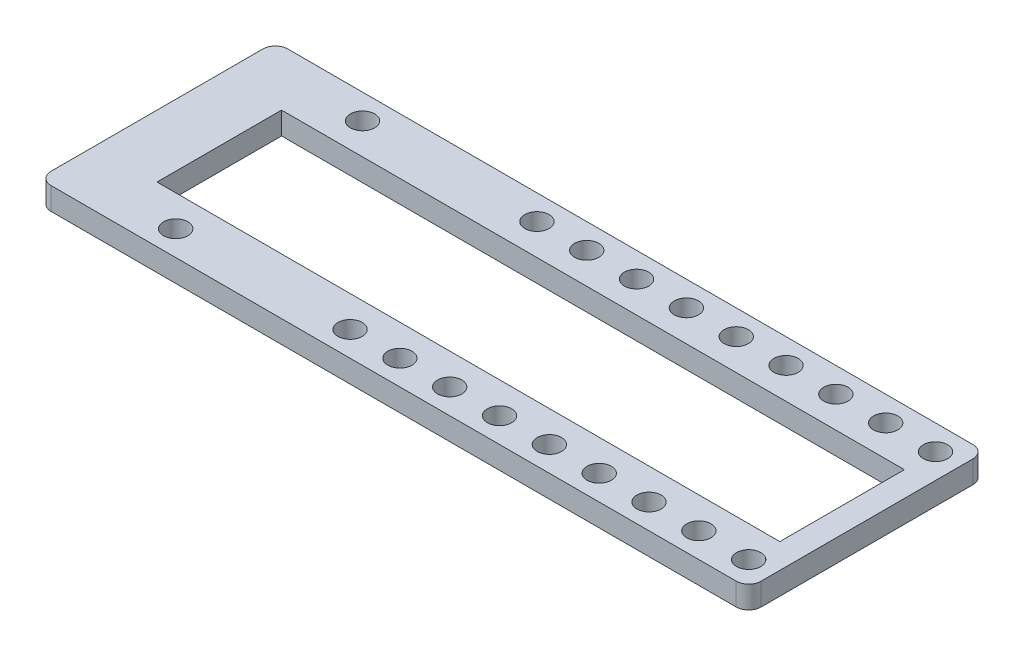
ISO-10303-21;
HEADER;
FILE_DESCRIPTION(('STEP AP214'),'2;1');
FILE_NAME('part.step','',(''),(''),'','','');
FILE_SCHEMA(('AUTOMOTIVE_DESIGN { 1 0 10303 214 1 1 1 1 }'));
ENDSEC;
DATA;
#1=APPLICATION_CONTEXT('core data for automotive mechanical design processes');
#2=APPLICATION_PROTOCOL_DEFINITION('international standard','automotive_design',2000,#1);
#3=PRODUCT_CONTEXT('',#1,'mechanical');
#4=PRODUCT('Part','Part','',(#3));
#5=PRODUCT_RELATED_PRODUCT_CATEGORY('part','',(#4));
#6=PRODUCT_DEFINITION_FORMATION('','',#4);
#7=PRODUCT_DEFINITION_CONTEXT('part definition',#1,'design');
#8=PRODUCT_DEFINITION('design','',#6,#7);
#9=PRODUCT_DEFINITION_SHAPE('','',#8);
#10=(LENGTH_UNIT() NAMED_UNIT(*) SI_UNIT(.MILLI.,.METRE.));
#11=(NAMED_UNIT(*) PLANE_ANGLE_UNIT() SI_UNIT($,.RADIAN.));
#12=(NAMED_UNIT(*) SI_UNIT($,.STERADIAN.) SOLID_ANGLE_UNIT());
#13=UNCERTAINTY_MEASURE_WITH_UNIT(LENGTH_MEASURE(1.E-05),#10,'distance_accuracy_value','');
#14=(GEOMETRIC_REPRESENTATION_CONTEXT(3) GLOBAL_UNCERTAINTY_ASSIGNED_CONTEXT((#13)) GLOBAL_UNIT_ASSIGNED_CONTEXT((#10,
#11,#12)) REPRESENTATION_CONTEXT('',''));
#15=CARTESIAN_POINT('',(0.,0.,0.));
#16=DIRECTION('',(0.,0.,1.));
#17=DIRECTION('',(1.,0.,0.));
#18=AXIS2_PLACEMENT_3D('',#15,#16,#17);
#19=CARTESIAN_POINT('',(112.,3.6,36.));
#20=DIRECTION('',(0.,-1.,0.));
#21=DIRECTION('',(0.,0.,-1.));
#22=AXIS2_PLACEMENT_3D('',#19,#20,#21);
#23=CYLINDRICAL_SURFACE('',#22,2.00000000000001);
#24=CARTESIAN_POINT('',(112.,0.,36.));
#25=DIRECTION('',(0.,1.,0.));
#26=DIRECTION('',(0.,0.,1.));
#27=AXIS2_PLACEMENT_3D('',#24,#25,#26);
#28=CIRCLE('',#27,2.00000000000001);
#29=CARTESIAN_POINT('',(112.,0.,38.));
#30=VERTEX_POINT('',#29);
#31=CARTESIAN_POINT('',(114.,0.,36.));
#32=VERTEX_POINT('',#31);
#33=EDGE_CURVE('E275',#30,#32,#28,.T.);
#34=ORIENTED_EDGE('',*,*,#33,.T.);
#35=DIRECTION('',(0.,-1.,0.));
#36=VECTOR('',#35,1.);
#37=CARTESIAN_POINT('',(114.,3.6,36.));
#38=LINE('',#37,#36);
#39=CARTESIAN_POINT('',(114.,3.6,36.));
#40=VERTEX_POINT('',#39);
#41=EDGE_CURVE('E11',#40,#32,#38,.T.);
#42=ORIENTED_EDGE('',*,*,#41,.F.);
#43=CARTESIAN_POINT('',(112.,3.6,36.));
#44=DIRECTION('',(0.,1.,0.));
#45=DIRECTION('',(0.,0.,1.));
#46=AXIS2_PLACEMENT_3D('',#43,#44,#45);
#47=CIRCLE('',#46,2.00000000000001);
#48=CARTESIAN_POINT('',(112.,3.6,38.));
#49=VERTEX_POINT('',#48);
#50=EDGE_CURVE('E278',#49,#40,#47,.T.);
#51=ORIENTED_EDGE('',*,*,#50,.F.);
#52=DIRECTION('',(0.,-1.,0.));
#53=VECTOR('',#52,1.);
#54=CARTESIAN_POINT('',(112.,3.6,38.));
#55=LINE('',#54,#53);
#56=EDGE_CURVE('E296',#49,#30,#55,.T.);
#57=ORIENTED_EDGE('',*,*,#56,.T.);
#58=EDGE_LOOP('',(#34,#42,#51,#57));
#59=FACE_BOUND('',#58,.T.);
#60=ADVANCED_FACE('F35',(#59),#23,.T.);
#61=CARTESIAN_POINT('',(114.,3.6,2.));
#62=DIRECTION('',(-1.,0.,0.));
#63=DIRECTION('',(0.,0.,1.));
#64=AXIS2_PLACEMENT_3D('',#61,#62,#63);
#65=PLANE('',#64);
#66=DIRECTION('',(0.,0.,-1.));
#67=VECTOR('',#66,1.);
#68=CARTESIAN_POINT('',(114.,0.,2.));
#69=LINE('',#68,#67);
#70=CARTESIAN_POINT('',(114.,0.,2.));
#71=VERTEX_POINT('',#70);
#72=EDGE_CURVE('E299',#32,#71,#69,.T.);
#73=ORIENTED_EDGE('',*,*,#72,.T.);
#74=DIRECTION('',(0.,-1.,0.));
#75=VECTOR('',#74,1.);
#76=CARTESIAN_POINT('',(114.,3.6,2.));
#77=LINE('',#76,#75);
#78=CARTESIAN_POINT('',(114.,3.6,2.));
#79=VERTEX_POINT('',#78);
#80=EDGE_CURVE('E42',#79,#71,#77,.T.);
#81=ORIENTED_EDGE('',*,*,#80,.F.);
#82=DIRECTION('',(0.,0.,-1.));
#83=VECTOR('',#82,1.);
#84=CARTESIAN_POINT('',(114.,3.6,2.));
#85=LINE('',#84,#83);
#86=EDGE_CURVE('E281',#40,#79,#85,.T.);
#87=ORIENTED_EDGE('',*,*,#86,.F.);
#88=ORIENTED_EDGE('',*,*,#41,.T.);
#89=EDGE_LOOP('',(#73,#81,#87,#88));
#90=FACE_BOUND('',#89,.T.);
#91=ADVANCED_FACE('F355',(#90),#65,.F.);
#92=CARTESIAN_POINT('',(112.,3.6,2.));
#93=DIRECTION('',(0.,-1.,0.));
#94=DIRECTION('',(0.,0.,-1.));
#95=AXIS2_PLACEMENT_3D('',#92,#93,#94);
#96=CYLINDRICAL_SURFACE('',#95,2.);
#97=CARTESIAN_POINT('',(112.,0.,2.));
#98=DIRECTION('',(0.,1.,0.));
#99=DIRECTION('',(0.,0.,-1.));
#100=AXIS2_PLACEMENT_3D('',#97,#98,#99);
#101=CIRCLE('',#100,2.);
#102=CARTESIAN_POINT('',(112.,0.,0.));
#103=VERTEX_POINT('',#102);
#104=EDGE_CURVE('E301',#71,#103,#101,.T.);
#105=ORIENTED_EDGE('',*,*,#104,.T.);
#106=DIRECTION('',(0.,-1.,0.));
#107=VECTOR('',#106,1.);
#108=CARTESIAN_POINT('',(112.,3.6,0.));
#109=LINE('',#108,#107);
#110=CARTESIAN_POINT('',(112.,3.6,0.));
#111=VERTEX_POINT('',#110);
#112=EDGE_CURVE('E326',#111,#103,#109,.T.);
#113=ORIENTED_EDGE('',*,*,#112,.F.);
#114=CARTESIAN_POINT('',(112.,3.6,2.));
#115=DIRECTION('',(0.,1.,0.));
#116=DIRECTION('',(0.,0.,-1.));
#117=AXIS2_PLACEMENT_3D('',#114,#115,#116);
#118=CIRCLE('',#117,2.);
#119=EDGE_CURVE('E284',#79,#111,#118,.T.);
#120=ORIENTED_EDGE('',*,*,#119,.F.);
#121=ORIENTED_EDGE('',*,*,#80,.T.);
#122=EDGE_LOOP('',(#105,#113,#120,#121));
#123=FACE_BOUND('',#122,.T.);
#124=ADVANCED_FACE('F333',(#123),#96,.T.);
#125=CARTESIAN_POINT('',(2.00000000000001,3.6,0.));
#126=DIRECTION('',(0.,0.,1.));
#127=DIRECTION('',(1.,0.,0.));
#128=AXIS2_PLACEMENT_3D('',#125,#126,#127);
#129=PLANE('',#128);
#130=DIRECTION('',(-1.,0.,0.));
#131=VECTOR('',#130,1.);
#132=CARTESIAN_POINT('',(2.00000000000001,0.,0.));
#133=LINE('',#132,#131);
#134=CARTESIAN_POINT('',(2.00000000000001,0.,0.));
#135=VERTEX_POINT('',#134);
#136=EDGE_CURVE('E303',#103,#135,#133,.T.);
#137=ORIENTED_EDGE('',*,*,#136,.T.);
#138=DIRECTION('',(0.,-1.,0.));
#139=VECTOR('',#138,1.);
#140=CARTESIAN_POINT('',(2.00000000000001,3.6,0.));
#141=LINE('',#140,#139);
#142=CARTESIAN_POINT('',(2.00000000000001,3.6,0.));
#143=VERTEX_POINT('',#142);
#144=EDGE_CURVE('E323',#143,#135,#141,.T.);
#145=ORIENTED_EDGE('',*,*,#144,.F.);
#146=DIRECTION('',(-1.,0.,0.));
#147=VECTOR('',#146,1.);
#148=CARTESIAN_POINT('',(2.00000000000001,3.6,0.));
#149=LINE('',#148,#147);
#150=EDGE_CURVE('E286',#111,#143,#149,.T.);
#151=ORIENTED_EDGE('',*,*,#150,.F.);
#152=ORIENTED_EDGE('',*,*,#112,.T.);
#153=EDGE_LOOP('',(#137,#145,#151,#152));
#154=FACE_BOUND('',#153,.T.);
#155=ADVANCED_FACE('F343',(#154),#129,.F.);
#156=CARTESIAN_POINT('',(2.,3.6,2.));
#157=DIRECTION('',(0.,-1.,0.));
#158=DIRECTION('',(0.,0.,-1.));
#159=AXIS2_PLACEMENT_3D('',#156,#157,#158);
#160=CYLINDRICAL_SURFACE('',#159,2.);
#161=CARTESIAN_POINT('',(2.,0.,2.));
#162=DIRECTION('',(0.,1.,0.));
#163=DIRECTION('',(0.,0.,1.));
#164=AXIS2_PLACEMENT_3D('',#161,#162,#163);
#165=CIRCLE('',#164,2.);
#166=CARTESIAN_POINT('',(0.,0.,2.00000000000001));
#167=VERTEX_POINT('',#166);
#168=EDGE_CURVE('E305',#135,#167,#165,.T.);
#169=ORIENTED_EDGE('',*,*,#168,.T.);
#170=DIRECTION('',(0.,-1.,0.));
#171=VECTOR('',#170,1.);
#172=CARTESIAN_POINT('',(0.,3.6,2.00000000000001));
#173=LINE('',#172,#171);
#174=CARTESIAN_POINT('',(0.,3.6,2.00000000000001));
#175=VERTEX_POINT('',#174);
#176=EDGE_CURVE('E320',#175,#167,#173,.T.);
#177=ORIENTED_EDGE('',*,*,#176,.F.);
#178=CARTESIAN_POINT('',(2.,3.6,2.));
#179=DIRECTION('',(0.,1.,0.));
#180=DIRECTION('',(0.,0.,1.));
#181=AXIS2_PLACEMENT_3D('',#178,#179,#180);
#182=CIRCLE('',#181,2.);
#183=EDGE_CURVE('E288',#143,#175,#182,.T.);
#184=ORIENTED_EDGE('',*,*,#183,.F.);
#185=ORIENTED_EDGE('',*,*,#144,.T.);
#186=EDGE_LOOP('',(#169,#177,#184,#185));
#187=FACE_BOUND('',#186,.T.);
#188=ADVANCED_FACE('F347',(#187),#160,.T.);
#189=CARTESIAN_POINT('',(0.,3.6,2.00000000000001));
#190=DIRECTION('',(1.,0.,0.));
#191=DIRECTION('',(0.,0.,-1.));
#192=AXIS2_PLACEMENT_3D('',#189,#190,#191);
#193=PLANE('',#192);
#194=DIRECTION('',(0.,0.,1.));
#195=VECTOR('',#194,1.);
#196=CARTESIAN_POINT('',(0.,0.,2.00000000000001));
#197=LINE('',#196,#195);
#198=CARTESIAN_POINT('',(0.,0.,36.));
#199=VERTEX_POINT('',#198);
#200=EDGE_CURVE('E307',#167,#199,#197,.T.);
#201=ORIENTED_EDGE('',*,*,#200,.T.);
#202=DIRECTION('',(0.,-1.,0.));
#203=VECTOR('',#202,1.);
#204=CARTESIAN_POINT('',(0.,3.6,36.));
#205=LINE('',#204,#203);
#206=CARTESIAN_POINT('',(0.,3.6,36.));
#207=VERTEX_POINT('',#206);
#208=EDGE_CURVE('E317',#207,#199,#205,.T.);
#209=ORIENTED_EDGE('',*,*,#208,.F.);
#210=DIRECTION('',(0.,0.,1.));
#211=VECTOR('',#210,1.);
#212=CARTESIAN_POINT('',(0.,3.6,2.00000000000001));
#213=LINE('',#212,#211);
#214=EDGE_CURVE('E290',#175,#207,#213,.T.);
#215=ORIENTED_EDGE('',*,*,#214,.F.);
#216=ORIENTED_EDGE('',*,*,#176,.T.);
#217=EDGE_LOOP('',(#201,#209,#215,#216));
#218=FACE_BOUND('',#217,.T.);
#219=ADVANCED_FACE('F368',(#218),#193,.F.);
#220=CARTESIAN_POINT('',(2.,3.6,36.));
#221=DIRECTION('',(0.,-1.,0.));
#222=DIRECTION('',(0.,0.,-1.));
#223=AXIS2_PLACEMENT_3D('',#220,#221,#222);
#224=CYLINDRICAL_SURFACE('',#223,2.);
#225=CARTESIAN_POINT('',(2.,0.,36.));
#226=DIRECTION('',(0.,1.,0.));
#227=DIRECTION('',(0.,0.,1.));
#228=AXIS2_PLACEMENT_3D('',#225,#226,#227);
#229=CIRCLE('',#228,2.);
#230=CARTESIAN_POINT('',(2.,0.,38.));
#231=VERTEX_POINT('',#230);
#232=EDGE_CURVE('E309',#199,#231,#229,.T.);
#233=ORIENTED_EDGE('',*,*,#232,.T.);
#234=DIRECTION('',(0.,-1.,0.));
#235=VECTOR('',#234,1.);
#236=CARTESIAN_POINT('',(2.,3.6,38.));
#237=LINE('',#236,#235);
#238=CARTESIAN_POINT('',(2.,3.6,38.));
#239=VERTEX_POINT('',#238);
#240=EDGE_CURVE('E314',#239,#231,#237,.T.);
#241=ORIENTED_EDGE('',*,*,#240,.F.);
#242=CARTESIAN_POINT('',(2.,3.6,36.));
#243=DIRECTION('',(0.,1.,0.));
#244=DIRECTION('',(0.,0.,1.));
#245=AXIS2_PLACEMENT_3D('',#242,#243,#244);
#246=CIRCLE('',#245,2.);
#247=EDGE_CURVE('E292',#207,#239,#246,.T.);
#248=ORIENTED_EDGE('',*,*,#247,.F.);
#249=ORIENTED_EDGE('',*,*,#208,.T.);
#250=EDGE_LOOP('',(#233,#241,#248,#249));
#251=FACE_BOUND('',#250,.T.);
#252=ADVANCED_FACE('F366',(#251),#224,.T.);
#253=CARTESIAN_POINT('',(2.,3.6,38.));
#254=DIRECTION('',(0.,0.,-1.));
#255=DIRECTION('',(-1.,0.,0.));
#256=AXIS2_PLACEMENT_3D('',#253,#254,#255);
#257=PLANE('',#256);
#258=DIRECTION('',(1.,0.,0.));
#259=VECTOR('',#258,1.);
#260=CARTESIAN_POINT('',(2.,0.,38.));
#261=LINE('',#260,#259);
#262=EDGE_CURVE('E282',#231,#30,#261,.T.);
#263=ORIENTED_EDGE('',*,*,#262,.T.);
#264=ORIENTED_EDGE('',*,*,#56,.F.);
#265=DIRECTION('',(1.,0.,0.));
#266=VECTOR('',#265,1.);
#267=CARTESIAN_POINT('',(2.,3.6,38.));
#268=LINE('',#267,#266);
#269=EDGE_CURVE('E294',#239,#49,#268,.T.);
#270=ORIENTED_EDGE('',*,*,#269,.F.);
#271=ORIENTED_EDGE('',*,*,#240,.T.);
#272=EDGE_LOOP('',(#263,#264,#270,#271));
#273=FACE_BOUND('',#272,.T.);
#274=ADVANCED_FACE('F361',(#273),#257,.F.);
#275=CARTESIAN_POINT('',(112.,3.6,36.));
#276=DIRECTION('',(0.,1.,0.));
#277=DIRECTION('',(0.,0.,1.));
#278=AXIS2_PLACEMENT_3D('',#275,#276,#277);
#279=PLANE('',#278);
#280=CARTESIAN_POINT('',(18.,3.6,34.));
#281=DIRECTION('',(0.,1.,0.));
#282=DIRECTION('',(0.,0.,1.));
#283=AXIS2_PLACEMENT_3D('',#280,#281,#282);
#284=CIRCLE('',#283,1.95);
#285=CARTESIAN_POINT('',(18.,3.6,35.95));
#286=VERTEX_POINT('',#285);
#287=EDGE_CURVE('E179',#286,#286,#284,.T.);
#288=ORIENTED_EDGE('',*,*,#287,.F.);
#289=EDGE_LOOP('',(#288));
#290=FACE_BOUND('',#289,.T.);
#291=CARTESIAN_POINT('',(102.,3.6,34.));
#292=DIRECTION('',(0.,1.,0.));
#293=DIRECTION('',(0.,0.,1.));
#294=AXIS2_PLACEMENT_3D('',#291,#292,#293);
#295=CIRCLE('',#294,1.95);
#296=CARTESIAN_POINT('',(102.,3.6,35.95));
#297=VERTEX_POINT('',#296);
#298=EDGE_CURVE('E204',#297,#297,#295,.T.);
#299=ORIENTED_EDGE('',*,*,#298,.F.);
#300=EDGE_LOOP('',(#299));
#301=FACE_BOUND('',#300,.T.);
#302=CARTESIAN_POINT('',(110.,3.6,34.));
#303=DIRECTION('',(0.,1.,0.));
#304=DIRECTION('',(0.,0.,1.));
#305=AXIS2_PLACEMENT_3D('',#302,#303,#304);
#306=CIRCLE('',#305,1.95);
#307=CARTESIAN_POINT('',(110.,3.6,35.95));
#308=VERTEX_POINT('',#307);
#309=EDGE_CURVE('E203',#308,#308,#306,.T.);
#310=ORIENTED_EDGE('',*,*,#309,.F.);
#311=EDGE_LOOP('',(#310));
#312=FACE_BOUND('',#311,.T.);
#313=CARTESIAN_POINT('',(94.,3.6,4.));
#314=DIRECTION('',(0.,1.,0.));
#315=DIRECTION('',(0.,0.,1.));
#316=AXIS2_PLACEMENT_3D('',#313,#314,#315);
#317=CIRCLE('',#316,1.95);
#318=CARTESIAN_POINT('',(94.,3.6,5.95));
#319=VERTEX_POINT('',#318);
#320=EDGE_CURVE('E216',#319,#319,#317,.T.);
#321=ORIENTED_EDGE('',*,*,#320,.F.);
#322=EDGE_LOOP('',(#321));
#323=FACE_BOUND('',#322,.T.);
#324=CARTESIAN_POINT('',(46.,3.6,34.));
#325=DIRECTION('',(0.,1.,0.));
#326=DIRECTION('',(0.,0.,1.));
#327=AXIS2_PLACEMENT_3D('',#324,#325,#326);
#328=CIRCLE('',#327,1.95);
#329=CARTESIAN_POINT('',(46.,3.6,35.95));
#330=VERTEX_POINT('',#329);
#331=EDGE_CURVE('E180',#330,#330,#328,.T.);
#332=ORIENTED_EDGE('',*,*,#331,.F.);
#333=EDGE_LOOP('',(#332));
#334=FACE_BOUND('',#333,.T.);
#335=CARTESIAN_POINT('',(54.,3.6,34.));
#336=DIRECTION('',(0.,1.,0.));
#337=DIRECTION('',(0.,0.,1.));
#338=AXIS2_PLACEMENT_3D('',#335,#336,#337);
#339=CIRCLE('',#338,1.95);
#340=CARTESIAN_POINT('',(54.,3.6,35.95));
#341=VERTEX_POINT('',#340);
#342=EDGE_CURVE('E186',#341,#341,#339,.T.);
#343=ORIENTED_EDGE('',*,*,#342,.F.);
#344=EDGE_LOOP('',(#343));
#345=FACE_BOUND('',#344,.T.);
#346=CARTESIAN_POINT('',(62.,3.6,34.));
#347=DIRECTION('',(0.,1.,0.));
#348=DIRECTION('',(0.,0.,1.));
#349=AXIS2_PLACEMENT_3D('',#346,#347,#348);
#350=CIRCLE('',#349,1.95000000000001);
#351=CARTESIAN_POINT('',(62.,3.6,35.95));
#352=VERTEX_POINT('',#351);
#353=EDGE_CURVE('E192',#352,#352,#350,.T.);
#354=ORIENTED_EDGE('',*,*,#353,.F.);
#355=EDGE_LOOP('',(#354));
#356=FACE_BOUND('',#355,.T.);
#357=CARTESIAN_POINT('',(70.,3.6,34.));
#358=DIRECTION('',(0.,1.,0.));
#359=DIRECTION('',(0.,0.,1.));
#360=AXIS2_PLACEMENT_3D('',#357,#358,#359);
#361=CIRCLE('',#360,1.95);
#362=CARTESIAN_POINT('',(70.,3.6,35.95));
#363=VERTEX_POINT('',#362);
#364=EDGE_CURVE('E165',#363,#363,#361,.T.);
#365=ORIENTED_EDGE('',*,*,#364,.F.);
#366=EDGE_LOOP('',(#365));
#367=FACE_BOUND('',#366,.T.);
#368=CARTESIAN_POINT('',(54.,3.6,4.00000000000001));
#369=DIRECTION('',(0.,1.,0.));
#370=DIRECTION('',(0.,0.,1.));
#371=AXIS2_PLACEMENT_3D('',#368,#369,#370);
#372=CIRCLE('',#371,1.95);
#373=CARTESIAN_POINT('',(54.,3.6,5.95));
#374=VERTEX_POINT('',#373);
#375=EDGE_CURVE('E227',#374,#374,#372,.T.);
#376=ORIENTED_EDGE('',*,*,#375,.F.);
#377=EDGE_LOOP('',(#376));
#378=FACE_BOUND('',#377,.T.);
#379=CARTESIAN_POINT('',(46.,3.6,4.00000000000001));
#380=DIRECTION('',(0.,1.,0.));
#381=DIRECTION('',(0.,0.,1.));
#382=AXIS2_PLACEMENT_3D('',#379,#380,#381);
#383=CIRCLE('',#382,1.95);
#384=CARTESIAN_POINT('',(46.,3.6,5.95));
#385=VERTEX_POINT('',#384);
#386=EDGE_CURVE('E252',#385,#385,#383,.T.);
#387=ORIENTED_EDGE('',*,*,#386,.F.);
#388=EDGE_LOOP('',(#387));
#389=FACE_BOUND('',#388,.T.);
#390=CARTESIAN_POINT('',(18.,3.6,4.00000000000001));
#391=DIRECTION('',(0.,1.,0.));
#392=DIRECTION('',(0.,0.,1.));
#393=AXIS2_PLACEMENT_3D('',#390,#391,#392);
#394=CIRCLE('',#393,1.95);
#395=CARTESIAN_POINT('',(18.,3.6,5.95000000000001));
#396=VERTEX_POINT('',#395);
#397=EDGE_CURVE('E251',#396,#396,#394,.T.);
#398=ORIENTED_EDGE('',*,*,#397,.F.);
#399=EDGE_LOOP('',(#398));
#400=FACE_BOUND('',#399,.T.);
#401=CARTESIAN_POINT('',(102.,3.6,4.));
#402=DIRECTION('',(0.,1.,0.));
#403=DIRECTION('',(0.,0.,1.));
#404=AXIS2_PLACEMENT_3D('',#401,#402,#403);
#405=CIRCLE('',#404,1.95);
#406=CARTESIAN_POINT('',(102.,3.6,5.95));
#407=VERTEX_POINT('',#406);
#408=EDGE_CURVE('E264',#407,#407,#405,.T.);
#409=ORIENTED_EDGE('',*,*,#408,.F.);
#410=EDGE_LOOP('',(#409));
#411=FACE_BOUND('',#410,.T.);
#412=CARTESIAN_POINT('',(62.,3.6,4.));
#413=DIRECTION('',(0.,1.,0.));
#414=DIRECTION('',(0.,0.,1.));
#415=AXIS2_PLACEMENT_3D('',#412,#413,#414);
#416=CIRCLE('',#415,1.95000000000001);
#417=CARTESIAN_POINT('',(62.,3.6,5.95000000000001));
#418=VERTEX_POINT('',#417);
#419=EDGE_CURVE('E228',#418,#418,#416,.T.);
#420=ORIENTED_EDGE('',*,*,#419,.F.);
#421=EDGE_LOOP('',(#420));
#422=FACE_BOUND('',#421,.T.);
#423=CARTESIAN_POINT('',(70.,3.6,4.));
#424=DIRECTION('',(0.,1.,0.));
#425=DIRECTION('',(0.,0.,1.));
#426=AXIS2_PLACEMENT_3D('',#423,#424,#425);
#427=CIRCLE('',#426,1.95);
#428=CARTESIAN_POINT('',(70.,3.6,5.95));
#429=VERTEX_POINT('',#428);
#430=EDGE_CURVE('E234',#429,#429,#427,.T.);
#431=ORIENTED_EDGE('',*,*,#430,.F.);
#432=EDGE_LOOP('',(#431));
#433=FACE_BOUND('',#432,.T.);
#434=CARTESIAN_POINT('',(78.,3.6,4.));
#435=DIRECTION('',(0.,1.,0.));
#436=DIRECTION('',(0.,0.,1.));
#437=AXIS2_PLACEMENT_3D('',#434,#435,#436);
#438=CIRCLE('',#437,1.95);
#439=CARTESIAN_POINT('',(78.,3.6,5.95));
#440=VERTEX_POINT('',#439);
#441=EDGE_CURVE('E240',#440,#440,#438,.T.);
#442=ORIENTED_EDGE('',*,*,#441,.F.);
#443=EDGE_LOOP('',(#442));
#444=FACE_BOUND('',#443,.T.);
#445=CARTESIAN_POINT('',(86.,3.6,4.));
#446=DIRECTION('',(0.,1.,0.));
#447=DIRECTION('',(0.,0.,1.));
#448=AXIS2_PLACEMENT_3D('',#445,#446,#447);
#449=CIRCLE('',#448,1.95);
#450=CARTESIAN_POINT('',(86.,3.6,5.95));
#451=VERTEX_POINT('',#450);
#452=EDGE_CURVE('E215',#451,#451,#449,.T.);
#453=ORIENTED_EDGE('',*,*,#452,.F.);
#454=EDGE_LOOP('',(#453));
#455=FACE_BOUND('',#454,.T.);
#456=DIRECTION('',(0.,0.,1.));
#457=VECTOR('',#456,1.);
#458=CARTESIAN_POINT('',(10.,3.6,9.));
#459=LINE('',#458,#457);
#460=CARTESIAN_POINT('',(10.,3.6,9.));
#461=VERTEX_POINT('',#460);
#462=CARTESIAN_POINT('',(10.,3.6,29.));
#463=VERTEX_POINT('',#462);
#464=EDGE_CURVE('E49',#461,#463,#459,.T.);
#465=ORIENTED_EDGE('',*,*,#464,.F.);
#466=DIRECTION('',(-1.,0.,0.));
#467=VECTOR('',#466,1.);
#468=CARTESIAN_POINT('',(10.,3.6,9.));
#469=LINE('',#468,#467);
#470=CARTESIAN_POINT('',(110.,3.6,9.));
#471=VERTEX_POINT('',#470);
#472=EDGE_CURVE('E141',#471,#461,#469,.T.);
#473=ORIENTED_EDGE('',*,*,#472,.F.);
#474=DIRECTION('',(0.,0.,-1.));
#475=VECTOR('',#474,1.);
#476=CARTESIAN_POINT('',(110.,3.6,9.));
#477=LINE('',#476,#475);
#478=CARTESIAN_POINT('',(110.,3.6,29.));
#479=VERTEX_POINT('',#478);
#480=EDGE_CURVE('E144',#479,#471,#477,.T.);
#481=ORIENTED_EDGE('',*,*,#480,.F.);
#482=DIRECTION('',(1.,0.,0.));
#483=VECTOR('',#482,1.);
#484=CARTESIAN_POINT('',(10.,3.6,29.));
#485=LINE('',#484,#483);
#486=EDGE_CURVE('E153',#463,#479,#485,.T.);
#487=ORIENTED_EDGE('',*,*,#486,.F.);
#488=EDGE_LOOP('',(#465,#473,#481,#487));
#489=FACE_BOUND('',#488,.T.);
#490=CARTESIAN_POINT('',(94.,3.6,34.));
#491=DIRECTION('',(0.,1.,0.));
#492=DIRECTION('',(0.,0.,1.));
#493=AXIS2_PLACEMENT_3D('',#490,#491,#492);
#494=CIRCLE('',#493,1.95);
#495=CARTESIAN_POINT('',(94.,3.6,35.95));
#496=VERTEX_POINT('',#495);
#497=EDGE_CURVE('E147',#496,#496,#494,.T.);
#498=ORIENTED_EDGE('',*,*,#497,.F.);
#499=EDGE_LOOP('',(#498));
#500=FACE_BOUND('',#499,.T.);
#501=CARTESIAN_POINT('',(86.,3.6,34.));
#502=DIRECTION('',(0.,1.,0.));
#503=DIRECTION('',(0.,0.,1.));
#504=AXIS2_PLACEMENT_3D('',#501,#502,#503);
#505=CIRCLE('',#504,1.95);
#506=CARTESIAN_POINT('',(86.,3.6,35.95));
#507=VERTEX_POINT('',#506);
#508=EDGE_CURVE('E172',#507,#507,#505,.T.);
#509=ORIENTED_EDGE('',*,*,#508,.F.);
#510=EDGE_LOOP('',(#509));
#511=FACE_BOUND('',#510,.T.);
#512=CARTESIAN_POINT('',(78.,3.6,34.));
#513=DIRECTION('',(0.,1.,0.));
#514=DIRECTION('',(0.,0.,1.));
#515=AXIS2_PLACEMENT_3D('',#512,#513,#514);
#516=CIRCLE('',#515,1.95);
#517=CARTESIAN_POINT('',(78.,3.6,35.95));
#518=VERTEX_POINT('',#517);
#519=EDGE_CURVE('E166',#518,#518,#516,.T.);
#520=ORIENTED_EDGE('',*,*,#519,.F.);
#521=EDGE_LOOP('',(#520));
#522=FACE_BOUND('',#521,.T.);
#523=CARTESIAN_POINT('',(110.,3.6,4.));
#524=DIRECTION('',(0.,1.,0.));
#525=DIRECTION('',(0.,0.,1.));
#526=AXIS2_PLACEMENT_3D('',#523,#524,#525);
#527=CIRCLE('',#526,1.95);
#528=CARTESIAN_POINT('',(110.,3.6,5.94999999999999));
#529=VERTEX_POINT('',#528);
#530=EDGE_CURVE('E263',#529,#529,#527,.T.);
#531=ORIENTED_EDGE('',*,*,#530,.F.);
#532=EDGE_LOOP('',(#531));
#533=FACE_BOUND('',#532,.T.);
#534=ORIENTED_EDGE('',*,*,#50,.T.);
#535=ORIENTED_EDGE('',*,*,#86,.T.);
#536=ORIENTED_EDGE('',*,*,#119,.T.);
#537=ORIENTED_EDGE('',*,*,#150,.T.);
#538=ORIENTED_EDGE('',*,*,#183,.T.);
#539=ORIENTED_EDGE('',*,*,#214,.T.);
#540=ORIENTED_EDGE('',*,*,#247,.T.);
#541=ORIENTED_EDGE('',*,*,#269,.T.);
#542=EDGE_LOOP('',(#534,#535,#536,#537,#538,#539,#540,#541));
#543=FACE_BOUND('',#542,.T.);
#544=ADVANCED_FACE('F351',(#290,#301,#312,#323,#334,#345,#356,#367,#378,#389,#400,#411,#422,
#433,#444,#455,#489,#500,#511,#522,#533,#543),#279,.T.);
#545=CARTESIAN_POINT('',(112.,0.,36.));
#546=DIRECTION('',(0.,1.,0.));
#547=DIRECTION('',(0.,0.,1.));
#548=AXIS2_PLACEMENT_3D('',#545,#546,#547);
#549=PLANE('',#548);
#550=CARTESIAN_POINT('',(18.,0.,34.));
#551=DIRECTION('',(0.,1.,0.));
#552=DIRECTION('',(0.,0.,1.));
#553=AXIS2_PLACEMENT_3D('',#550,#551,#552);
#554=CIRCLE('',#553,1.95);
#555=CARTESIAN_POINT('',(18.,0.,35.95));
#556=VERTEX_POINT('',#555);
#557=EDGE_CURVE('E207',#556,#556,#554,.T.);
#558=ORIENTED_EDGE('',*,*,#557,.T.);
#559=EDGE_LOOP('',(#558));
#560=FACE_BOUND('',#559,.T.);
#561=CARTESIAN_POINT('',(102.,0.,34.));
#562=DIRECTION('',(0.,1.,0.));
#563=DIRECTION('',(0.,0.,1.));
#564=AXIS2_PLACEMENT_3D('',#561,#562,#563);
#565=CIRCLE('',#564,1.95);
#566=CARTESIAN_POINT('',(102.,0.,35.95));
#567=VERTEX_POINT('',#566);
#568=EDGE_CURVE('E200',#567,#567,#565,.T.);
#569=ORIENTED_EDGE('',*,*,#568,.T.);
#570=EDGE_LOOP('',(#569));
#571=FACE_BOUND('',#570,.T.);
#572=CARTESIAN_POINT('',(110.,0.,34.));
#573=DIRECTION('',(0.,1.,0.));
#574=DIRECTION('',(0.,0.,1.));
#575=AXIS2_PLACEMENT_3D('',#572,#573,#574);
#576=CIRCLE('',#575,1.95);
#577=CARTESIAN_POINT('',(110.,0.,35.95));
#578=VERTEX_POINT('',#577);
#579=EDGE_CURVE('E219',#578,#578,#576,.T.);
#580=ORIENTED_EDGE('',*,*,#579,.T.);
#581=EDGE_LOOP('',(#580));
#582=FACE_BOUND('',#581,.T.);
#583=CARTESIAN_POINT('',(94.,0.,4.));
#584=DIRECTION('',(0.,1.,0.));
#585=DIRECTION('',(0.,0.,1.));
#586=AXIS2_PLACEMENT_3D('',#583,#584,#585);
#587=CIRCLE('',#586,1.95);
#588=CARTESIAN_POINT('',(94.,0.,5.95));
#589=VERTEX_POINT('',#588);
#590=EDGE_CURVE('E212',#589,#589,#587,.T.);
#591=ORIENTED_EDGE('',*,*,#590,.T.);
#592=EDGE_LOOP('',(#591));
#593=FACE_BOUND('',#592,.T.);
#594=CARTESIAN_POINT('',(46.,0.,34.));
#595=DIRECTION('',(0.,1.,0.));
#596=DIRECTION('',(0.,0.,1.));
#597=AXIS2_PLACEMENT_3D('',#594,#595,#596);
#598=CIRCLE('',#597,1.95);
#599=CARTESIAN_POINT('',(46.,0.,35.95));
#600=VERTEX_POINT('',#599);
#601=EDGE_CURVE('E176',#600,#600,#598,.T.);
#602=ORIENTED_EDGE('',*,*,#601,.T.);
#603=EDGE_LOOP('',(#602));
#604=FACE_BOUND('',#603,.T.);
#605=CARTESIAN_POINT('',(54.,0.,34.));
#606=DIRECTION('',(0.,1.,0.));
#607=DIRECTION('',(0.,0.,1.));
#608=AXIS2_PLACEMENT_3D('',#605,#606,#607);
#609=CIRCLE('',#608,1.95);
#610=CARTESIAN_POINT('',(54.,0.,35.95));
#611=VERTEX_POINT('',#610);
#612=EDGE_CURVE('E183',#611,#611,#609,.T.);
#613=ORIENTED_EDGE('',*,*,#612,.T.);
#614=EDGE_LOOP('',(#613));
#615=FACE_BOUND('',#614,.T.);
#616=CARTESIAN_POINT('',(62.,0.,34.));
#617=DIRECTION('',(0.,1.,0.));
#618=DIRECTION('',(0.,0.,1.));
#619=AXIS2_PLACEMENT_3D('',#616,#617,#618);
#620=CIRCLE('',#619,1.95000000000001);
#621=CARTESIAN_POINT('',(62.,0.,35.95));
#622=VERTEX_POINT('',#621);
#623=EDGE_CURVE('E189',#622,#622,#620,.T.);
#624=ORIENTED_EDGE('',*,*,#623,.T.);
#625=EDGE_LOOP('',(#624));
#626=FACE_BOUND('',#625,.T.);
#627=CARTESIAN_POINT('',(70.,0.,34.));
#628=DIRECTION('',(0.,1.,0.));
#629=DIRECTION('',(0.,0.,1.));
#630=AXIS2_PLACEMENT_3D('',#627,#628,#629);
#631=CIRCLE('',#630,1.95);
#632=CARTESIAN_POINT('',(70.,0.,35.95));
#633=VERTEX_POINT('',#632);
#634=EDGE_CURVE('E195',#633,#633,#631,.T.);
#635=ORIENTED_EDGE('',*,*,#634,.T.);
#636=EDGE_LOOP('',(#635));
#637=FACE_BOUND('',#636,.T.);
#638=CARTESIAN_POINT('',(54.,0.,4.00000000000001));
#639=DIRECTION('',(0.,1.,0.));
#640=DIRECTION('',(0.,0.,1.));
#641=AXIS2_PLACEMENT_3D('',#638,#639,#640);
#642=CIRCLE('',#641,1.95);
#643=CARTESIAN_POINT('',(54.,0.,5.95));
#644=VERTEX_POINT('',#643);
#645=EDGE_CURVE('E255',#644,#644,#642,.T.);
#646=ORIENTED_EDGE('',*,*,#645,.T.);
#647=EDGE_LOOP('',(#646));
#648=FACE_BOUND('',#647,.T.);
#649=CARTESIAN_POINT('',(46.,0.,4.00000000000001));
#650=DIRECTION('',(0.,1.,0.));
#651=DIRECTION('',(0.,0.,1.));
#652=AXIS2_PLACEMENT_3D('',#649,#650,#651);
#653=CIRCLE('',#652,1.95);
#654=CARTESIAN_POINT('',(46.,0.,5.95));
#655=VERTEX_POINT('',#654);
#656=EDGE_CURVE('E248',#655,#655,#653,.T.);
#657=ORIENTED_EDGE('',*,*,#656,.T.);
#658=EDGE_LOOP('',(#657));
#659=FACE_BOUND('',#658,.T.);
#660=CARTESIAN_POINT('',(18.,0.,4.00000000000001));
#661=DIRECTION('',(0.,1.,0.));
#662=DIRECTION('',(0.,0.,1.));
#663=AXIS2_PLACEMENT_3D('',#660,#661,#662);
#664=CIRCLE('',#663,1.95);
#665=CARTESIAN_POINT('',(18.,0.,5.95000000000001));
#666=VERTEX_POINT('',#665);
#667=EDGE_CURVE('E267',#666,#666,#664,.T.);
#668=ORIENTED_EDGE('',*,*,#667,.T.);
#669=EDGE_LOOP('',(#668));
#670=FACE_BOUND('',#669,.T.);
#671=CARTESIAN_POINT('',(102.,0.,4.));
#672=DIRECTION('',(0.,1.,0.));
#673=DIRECTION('',(0.,0.,1.));
#674=AXIS2_PLACEMENT_3D('',#671,#672,#673);
#675=CIRCLE('',#674,1.95);
#676=CARTESIAN_POINT('',(102.,0.,5.95));
#677=VERTEX_POINT('',#676);
#678=EDGE_CURVE('E260',#677,#677,#675,.T.);
#679=ORIENTED_EDGE('',*,*,#678,.T.);
#680=EDGE_LOOP('',(#679));
#681=FACE_BOUND('',#680,.T.);
#682=CARTESIAN_POINT('',(62.,0.,4.));
#683=DIRECTION('',(0.,1.,0.));
#684=DIRECTION('',(0.,0.,1.));
#685=AXIS2_PLACEMENT_3D('',#682,#683,#684);
#686=CIRCLE('',#685,1.95000000000001);
#687=CARTESIAN_POINT('',(62.,0.,5.95000000000001));
#688=VERTEX_POINT('',#687);
#689=EDGE_CURVE('E224',#688,#688,#686,.T.);
#690=ORIENTED_EDGE('',*,*,#689,.T.);
#691=EDGE_LOOP('',(#690));
#692=FACE_BOUND('',#691,.T.);
#693=CARTESIAN_POINT('',(70.,0.,4.));
#694=DIRECTION('',(0.,1.,0.));
#695=DIRECTION('',(0.,0.,1.));
#696=AXIS2_PLACEMENT_3D('',#693,#694,#695);
#697=CIRCLE('',#696,1.95);
#698=CARTESIAN_POINT('',(70.,0.,5.95));
#699=VERTEX_POINT('',#698);
#700=EDGE_CURVE('E231',#699,#699,#697,.T.);
#701=ORIENTED_EDGE('',*,*,#700,.T.);
#702=EDGE_LOOP('',(#701));
#703=FACE_BOUND('',#702,.T.);
#704=CARTESIAN_POINT('',(78.,0.,4.));
#705=DIRECTION('',(0.,1.,0.));
#706=DIRECTION('',(0.,0.,1.));
#707=AXIS2_PLACEMENT_3D('',#704,#705,#706);
#708=CIRCLE('',#707,1.95);
#709=CARTESIAN_POINT('',(78.,0.,5.95));
#710=VERTEX_POINT('',#709);
#711=EDGE_CURVE('E237',#710,#710,#708,.T.);
#712=ORIENTED_EDGE('',*,*,#711,.T.);
#713=EDGE_LOOP('',(#712));
#714=FACE_BOUND('',#713,.T.);
#715=CARTESIAN_POINT('',(86.,0.,4.));
#716=DIRECTION('',(0.,1.,0.));
#717=DIRECTION('',(0.,0.,1.));
#718=AXIS2_PLACEMENT_3D('',#715,#716,#717);
#719=CIRCLE('',#718,1.95);
#720=CARTESIAN_POINT('',(86.,0.,5.95));
#721=VERTEX_POINT('',#720);
#722=EDGE_CURVE('E243',#721,#721,#719,.T.);
#723=ORIENTED_EDGE('',*,*,#722,.T.);
#724=EDGE_LOOP('',(#723));
#725=FACE_BOUND('',#724,.T.);
#726=DIRECTION('',(-1.,0.,0.));
#727=VECTOR('',#726,1.);
#728=CARTESIAN_POINT('',(10.,0.,9.));
#729=LINE('',#728,#727);
#730=CARTESIAN_POINT('',(110.,0.,9.));
#731=VERTEX_POINT('',#730);
#732=CARTESIAN_POINT('',(10.,0.,9.));
#733=VERTEX_POINT('',#732);
#734=EDGE_CURVE('E131',#731,#733,#729,.T.);
#735=ORIENTED_EDGE('',*,*,#734,.T.);
#736=DIRECTION('',(0.,0.,1.));
#737=VECTOR('',#736,1.);
#738=CARTESIAN_POINT('',(10.,0.,9.));
#739=LINE('',#738,#737);
#740=CARTESIAN_POINT('',(10.,0.,29.));
#741=VERTEX_POINT('',#740);
#742=EDGE_CURVE('E125',#733,#741,#739,.T.);
#743=ORIENTED_EDGE('',*,*,#742,.T.);
#744=DIRECTION('',(1.,0.,0.));
#745=VECTOR('',#744,1.);
#746=CARTESIAN_POINT('',(10.,0.,29.));
#747=LINE('',#746,#745);
#748=CARTESIAN_POINT('',(110.,0.,29.));
#749=VERTEX_POINT('',#748);
#750=EDGE_CURVE('E134',#741,#749,#747,.T.);
#751=ORIENTED_EDGE('',*,*,#750,.T.);
#752=DIRECTION('',(0.,0.,-1.));
#753=VECTOR('',#752,1.);
#754=CARTESIAN_POINT('',(110.,0.,9.));
#755=LINE('',#754,#753);
#756=EDGE_CURVE('E57',#749,#731,#755,.T.);
#757=ORIENTED_EDGE('',*,*,#756,.T.);
#758=EDGE_LOOP('',(#735,#743,#751,#757));
#759=FACE_BOUND('',#758,.T.);
#760=CARTESIAN_POINT('',(94.,0.,34.));
#761=DIRECTION('',(0.,1.,0.));
#762=DIRECTION('',(0.,0.,1.));
#763=AXIS2_PLACEMENT_3D('',#760,#761,#762);
#764=CIRCLE('',#763,1.95);
#765=CARTESIAN_POINT('',(94.,0.,35.95));
#766=VERTEX_POINT('',#765);
#767=EDGE_CURVE('E175',#766,#766,#764,.T.);
#768=ORIENTED_EDGE('',*,*,#767,.T.);
#769=EDGE_LOOP('',(#768));
#770=FACE_BOUND('',#769,.T.);
#771=CARTESIAN_POINT('',(86.,0.,34.));
#772=DIRECTION('',(0.,1.,0.));
#773=DIRECTION('',(0.,0.,1.));
#774=AXIS2_PLACEMENT_3D('',#771,#772,#773);
#775=CIRCLE('',#774,1.95);
#776=CARTESIAN_POINT('',(86.,0.,35.95));
#777=VERTEX_POINT('',#776);
#778=EDGE_CURVE('E169',#777,#777,#775,.T.);
#779=ORIENTED_EDGE('',*,*,#778,.T.);
#780=EDGE_LOOP('',(#779));
#781=FACE_BOUND('',#780,.T.);
#782=CARTESIAN_POINT('',(78.,0.,34.));
#783=DIRECTION('',(0.,1.,0.));
#784=DIRECTION('',(0.,0.,1.));
#785=AXIS2_PLACEMENT_3D('',#782,#783,#784);
#786=CIRCLE('',#785,1.95);
#787=CARTESIAN_POINT('',(78.,0.,35.95));
#788=VERTEX_POINT('',#787);
#789=EDGE_CURVE('E162',#788,#788,#786,.T.);
#790=ORIENTED_EDGE('',*,*,#789,.T.);
#791=EDGE_LOOP('',(#790));
#792=FACE_BOUND('',#791,.T.);
#793=CARTESIAN_POINT('',(110.,0.,4.));
#794=DIRECTION('',(0.,1.,0.));
#795=DIRECTION('',(0.,0.,1.));
#796=AXIS2_PLACEMENT_3D('',#793,#794,#795);
#797=CIRCLE('',#796,1.95);
#798=CARTESIAN_POINT('',(110.,0.,5.94999999999999));
#799=VERTEX_POINT('',#798);
#800=EDGE_CURVE('E272',#799,#799,#797,.T.);
#801=ORIENTED_EDGE('',*,*,#800,.T.);
#802=EDGE_LOOP('',(#801));
#803=FACE_BOUND('',#802,.T.);
#804=ORIENTED_EDGE('',*,*,#33,.F.);
#805=ORIENTED_EDGE('',*,*,#262,.F.);
#806=ORIENTED_EDGE('',*,*,#232,.F.);
#807=ORIENTED_EDGE('',*,*,#200,.F.);
#808=ORIENTED_EDGE('',*,*,#168,.F.);
#809=ORIENTED_EDGE('',*,*,#136,.F.);
#810=ORIENTED_EDGE('',*,*,#104,.F.);
#811=ORIENTED_EDGE('',*,*,#72,.F.);
#812=EDGE_LOOP('',(#804,#805,#806,#807,#808,#809,#810,#811));
#813=FACE_BOUND('',#812,.T.);
#814=ADVANCED_FACE('F138',(#560,#571,#582,#593,#604,#615,#626,#637,#648,#659,#670,#681,#692,
#703,#714,#725,#759,#770,#781,#792,#803,#813),#549,.F.);
#815=CARTESIAN_POINT('',(110.,0.,4.));
#816=DIRECTION('',(0.,1.,0.));
#817=DIRECTION('',(0.,0.,1.));
#818=AXIS2_PLACEMENT_3D('',#815,#816,#817);
#819=CYLINDRICAL_SURFACE('',#818,1.95);
#820=ORIENTED_EDGE('',*,*,#800,.F.);
#821=EDGE_LOOP('',(#820));
#822=FACE_BOUND('',#821,.T.);
#823=ORIENTED_EDGE('',*,*,#530,.T.);
#824=EDGE_LOOP('',(#823));
#825=FACE_BOUND('',#824,.T.);
#826=ADVANCED_FACE('F431',(#822,#825),#819,.F.);
#827=CARTESIAN_POINT('',(78.,0.,34.));
#828=DIRECTION('',(0.,1.,0.));
#829=DIRECTION('',(0.,0.,1.));
#830=AXIS2_PLACEMENT_3D('',#827,#828,#829);
#831=CYLINDRICAL_SURFACE('',#830,1.95);
#832=ORIENTED_EDGE('',*,*,#789,.F.);
#833=EDGE_LOOP('',(#832));
#834=FACE_BOUND('',#833,.T.);
#835=ORIENTED_EDGE('',*,*,#519,.T.);
#836=EDGE_LOOP('',(#835));
#837=FACE_BOUND('',#836,.T.);
#838=ADVANCED_FACE('F441',(#834,#837),#831,.F.);
#839=CARTESIAN_POINT('',(86.,0.,34.));
#840=DIRECTION('',(0.,1.,0.));
#841=DIRECTION('',(0.,0.,1.));
#842=AXIS2_PLACEMENT_3D('',#839,#840,#841);
#843=CYLINDRICAL_SURFACE('',#842,1.95);
#844=ORIENTED_EDGE('',*,*,#778,.F.);
#845=EDGE_LOOP('',(#844));
#846=FACE_BOUND('',#845,.T.);
#847=ORIENTED_EDGE('',*,*,#508,.T.);
#848=EDGE_LOOP('',(#847));
#849=FACE_BOUND('',#848,.T.);
#850=ADVANCED_FACE('F451',(#846,#849),#843,.F.);
#851=CARTESIAN_POINT('',(94.,0.,34.));
#852=DIRECTION('',(0.,1.,0.));
#853=DIRECTION('',(0.,0.,1.));
#854=AXIS2_PLACEMENT_3D('',#851,#852,#853);
#855=CYLINDRICAL_SURFACE('',#854,1.95);
#856=ORIENTED_EDGE('',*,*,#767,.F.);
#857=EDGE_LOOP('',(#856));
#858=FACE_BOUND('',#857,.T.);
#859=ORIENTED_EDGE('',*,*,#497,.T.);
#860=EDGE_LOOP('',(#859));
#861=FACE_BOUND('',#860,.T.);
#862=ADVANCED_FACE('F461',(#858,#861),#855,.F.);
#863=CARTESIAN_POINT('',(10.,0.,9.));
#864=DIRECTION('',(-1.,0.,0.));
#865=DIRECTION('',(0.,0.,1.));
#866=AXIS2_PLACEMENT_3D('',#863,#864,#865);
#867=PLANE('',#866);
#868=ORIENTED_EDGE('',*,*,#464,.T.);
#869=DIRECTION('',(0.,1.,0.));
#870=VECTOR('',#869,1.);
#871=CARTESIAN_POINT('',(10.,0.,29.));
#872=LINE('',#871,#870);
#873=EDGE_CURVE('E121',#741,#463,#872,.T.);
#874=ORIENTED_EDGE('',*,*,#873,.F.);
#875=ORIENTED_EDGE('',*,*,#742,.F.);
#876=DIRECTION('',(0.,1.,0.));
#877=VECTOR('',#876,1.);
#878=CARTESIAN_POINT('',(10.,0.,9.));
#879=LINE('',#878,#877);
#880=EDGE_CURVE('E157',#733,#461,#879,.T.);
#881=ORIENTED_EDGE('',*,*,#880,.T.);
#882=EDGE_LOOP('',(#868,#874,#875,#881));
#883=FACE_BOUND('',#882,.T.);
#884=ADVANCED_FACE('F123',(#883),#867,.F.);
#885=CARTESIAN_POINT('',(10.,0.,9.));
#886=DIRECTION('',(0.,0.,-1.));
#887=DIRECTION('',(-1.,0.,0.));
#888=AXIS2_PLACEMENT_3D('',#885,#886,#887);
#889=PLANE('',#888);
#890=ORIENTED_EDGE('',*,*,#472,.T.);
#891=ORIENTED_EDGE('',*,*,#880,.F.);
#892=ORIENTED_EDGE('',*,*,#734,.F.);
#893=DIRECTION('',(0.,1.,0.));
#894=VECTOR('',#893,1.);
#895=CARTESIAN_POINT('',(110.,0.,9.));
#896=LINE('',#895,#894);
#897=EDGE_CURVE('E159',#731,#471,#896,.T.);
#898=ORIENTED_EDGE('',*,*,#897,.T.);
#899=EDGE_LOOP('',(#890,#891,#892,#898));
#900=FACE_BOUND('',#899,.T.);
#901=ADVANCED_FACE('F480',(#900),#889,.F.);
#902=CARTESIAN_POINT('',(110.,0.,9.));
#903=DIRECTION('',(1.,0.,0.));
#904=DIRECTION('',(0.,0.,-1.));
#905=AXIS2_PLACEMENT_3D('',#902,#903,#904);
#906=PLANE('',#905);
#907=ORIENTED_EDGE('',*,*,#480,.T.);
#908=ORIENTED_EDGE('',*,*,#897,.F.);
#909=ORIENTED_EDGE('',*,*,#756,.F.);
#910=DIRECTION('',(0.,1.,0.));
#911=VECTOR('',#910,1.);
#912=CARTESIAN_POINT('',(110.,0.,29.));
#913=LINE('',#912,#911);
#914=EDGE_CURVE('E130',#749,#479,#913,.T.);
#915=ORIENTED_EDGE('',*,*,#914,.T.);
#916=EDGE_LOOP('',(#907,#908,#909,#915));
#917=FACE_BOUND('',#916,.T.);
#918=ADVANCED_FACE('F489',(#917),#906,.F.);
#919=CARTESIAN_POINT('',(10.,0.,29.));
#920=DIRECTION('',(0.,0.,1.));
#921=DIRECTION('',(1.,0.,0.));
#922=AXIS2_PLACEMENT_3D('',#919,#920,#921);
#923=PLANE('',#922);
#924=ORIENTED_EDGE('',*,*,#486,.T.);
#925=ORIENTED_EDGE('',*,*,#914,.F.);
#926=ORIENTED_EDGE('',*,*,#750,.F.);
#927=ORIENTED_EDGE('',*,*,#873,.T.);
#928=EDGE_LOOP('',(#924,#925,#926,#927));
#929=FACE_BOUND('',#928,.T.);
#930=ADVANCED_FACE('F135',(#929),#923,.F.);
#931=CARTESIAN_POINT('',(86.,0.,4.));
#932=DIRECTION('',(0.,1.,0.));
#933=DIRECTION('',(0.,0.,1.));
#934=AXIS2_PLACEMENT_3D('',#931,#932,#933);
#935=CYLINDRICAL_SURFACE('',#934,1.95);
#936=ORIENTED_EDGE('',*,*,#722,.F.);
#937=EDGE_LOOP('',(#936));
#938=FACE_BOUND('',#937,.T.);
#939=ORIENTED_EDGE('',*,*,#452,.T.);
#940=EDGE_LOOP('',(#939));
#941=FACE_BOUND('',#940,.T.);
#942=ADVANCED_FACE('F507',(#938,#941),#935,.F.);
#943=CARTESIAN_POINT('',(78.,0.,4.));
#944=DIRECTION('',(0.,1.,0.));
#945=DIRECTION('',(0.,0.,1.));
#946=AXIS2_PLACEMENT_3D('',#943,#944,#945);
#947=CYLINDRICAL_SURFACE('',#946,1.95);
#948=ORIENTED_EDGE('',*,*,#711,.F.);
#949=EDGE_LOOP('',(#948));
#950=FACE_BOUND('',#949,.T.);
#951=ORIENTED_EDGE('',*,*,#441,.T.);
#952=EDGE_LOOP('',(#951));
#953=FACE_BOUND('',#952,.T.);
#954=ADVANCED_FACE('F516',(#950,#953),#947,.F.);
#955=CARTESIAN_POINT('',(70.,0.,4.));
#956=DIRECTION('',(0.,1.,0.));
#957=DIRECTION('',(0.,0.,1.));
#958=AXIS2_PLACEMENT_3D('',#955,#956,#957);
#959=CYLINDRICAL_SURFACE('',#958,1.95);
#960=ORIENTED_EDGE('',*,*,#700,.F.);
#961=EDGE_LOOP('',(#960));
#962=FACE_BOUND('',#961,.T.);
#963=ORIENTED_EDGE('',*,*,#430,.T.);
#964=EDGE_LOOP('',(#963));
#965=FACE_BOUND('',#964,.T.);
#966=ADVANCED_FACE('F526',(#962,#965),#959,.F.);
#967=CARTESIAN_POINT('',(62.,0.,4.));
#968=DIRECTION('',(0.,1.,0.));
#969=DIRECTION('',(0.,0.,1.));
#970=AXIS2_PLACEMENT_3D('',#967,#968,#969);
#971=CYLINDRICAL_SURFACE('',#970,1.95000000000001);
#972=ORIENTED_EDGE('',*,*,#689,.F.);
#973=EDGE_LOOP('',(#972));
#974=FACE_BOUND('',#973,.T.);
#975=ORIENTED_EDGE('',*,*,#419,.T.);
#976=EDGE_LOOP('',(#975));
#977=FACE_BOUND('',#976,.T.);
#978=ADVANCED_FACE('F536',(#974,#977),#971,.F.);
#979=CARTESIAN_POINT('',(102.,0.,4.));
#980=DIRECTION('',(0.,1.,0.));
#981=DIRECTION('',(0.,0.,1.));
#982=AXIS2_PLACEMENT_3D('',#979,#980,#981);
#983=CYLINDRICAL_SURFACE('',#982,1.95);
#984=ORIENTED_EDGE('',*,*,#678,.F.);
#985=EDGE_LOOP('',(#984));
#986=FACE_BOUND('',#985,.T.);
#987=ORIENTED_EDGE('',*,*,#408,.T.);
#988=EDGE_LOOP('',(#987));
#989=FACE_BOUND('',#988,.T.);
#990=ADVANCED_FACE('F546',(#986,#989),#983,.F.);
#991=CARTESIAN_POINT('',(18.,0.,4.00000000000001));
#992=DIRECTION('',(0.,1.,0.));
#993=DIRECTION('',(0.,0.,1.));
#994=AXIS2_PLACEMENT_3D('',#991,#992,#993);
#995=CYLINDRICAL_SURFACE('',#994,1.95);
#996=ORIENTED_EDGE('',*,*,#667,.F.);
#997=EDGE_LOOP('',(#996));
#998=FACE_BOUND('',#997,.T.);
#999=ORIENTED_EDGE('',*,*,#397,.T.);
#1000=EDGE_LOOP('',(#999));
#1001=FACE_BOUND('',#1000,.T.);
#1002=ADVANCED_FACE('F556',(#998,#1001),#995,.F.);
#1003=CARTESIAN_POINT('',(46.,0.,4.00000000000001));
#1004=DIRECTION('',(0.,1.,0.));
#1005=DIRECTION('',(0.,0.,1.));
#1006=AXIS2_PLACEMENT_3D('',#1003,#1004,#1005);
#1007=CYLINDRICAL_SURFACE('',#1006,1.95);
#1008=ORIENTED_EDGE('',*,*,#656,.F.);
#1009=EDGE_LOOP('',(#1008));
#1010=FACE_BOUND('',#1009,.T.);
#1011=ORIENTED_EDGE('',*,*,#386,.T.);
#1012=EDGE_LOOP('',(#1011));
#1013=FACE_BOUND('',#1012,.T.);
#1014=ADVANCED_FACE('F566',(#1010,#1013),#1007,.F.);
#1015=CARTESIAN_POINT('',(54.,0.,4.00000000000001));
#1016=DIRECTION('',(0.,1.,0.));
#1017=DIRECTION('',(0.,0.,1.));
#1018=AXIS2_PLACEMENT_3D('',#1015,#1016,#1017);
#1019=CYLINDRICAL_SURFACE('',#1018,1.95);
#1020=ORIENTED_EDGE('',*,*,#645,.F.);
#1021=EDGE_LOOP('',(#1020));
#1022=FACE_BOUND('',#1021,.T.);
#1023=ORIENTED_EDGE('',*,*,#375,.T.);
#1024=EDGE_LOOP('',(#1023));
#1025=FACE_BOUND('',#1024,.T.);
#1026=ADVANCED_FACE('F576',(#1022,#1025),#1019,.F.);
#1027=CARTESIAN_POINT('',(70.,0.,34.));
#1028=DIRECTION('',(0.,1.,0.));
#1029=DIRECTION('',(0.,0.,1.));
#1030=AXIS2_PLACEMENT_3D('',#1027,#1028,#1029);
#1031=CYLINDRICAL_SURFACE('',#1030,1.95);
#1032=ORIENTED_EDGE('',*,*,#634,.F.);
#1033=EDGE_LOOP('',(#1032));
#1034=FACE_BOUND('',#1033,.T.);
#1035=ORIENTED_EDGE('',*,*,#364,.T.);
#1036=EDGE_LOOP('',(#1035));
#1037=FACE_BOUND('',#1036,.T.);
#1038=ADVANCED_FACE('F586',(#1034,#1037),#1031,.F.);
#1039=CARTESIAN_POINT('',(62.,0.,34.));
#1040=DIRECTION('',(0.,1.,0.));
#1041=DIRECTION('',(0.,0.,1.));
#1042=AXIS2_PLACEMENT_3D('',#1039,#1040,#1041);
#1043=CYLINDRICAL_SURFACE('',#1042,1.95000000000001);
#1044=ORIENTED_EDGE('',*,*,#623,.F.);
#1045=EDGE_LOOP('',(#1044));
#1046=FACE_BOUND('',#1045,.T.);
#1047=ORIENTED_EDGE('',*,*,#353,.T.);
#1048=EDGE_LOOP('',(#1047));
#1049=FACE_BOUND('',#1048,.T.);
#1050=ADVANCED_FACE('F596',(#1046,#1049),#1043,.F.);
#1051=CARTESIAN_POINT('',(54.,0.,34.));
#1052=DIRECTION('',(0.,1.,0.));
#1053=DIRECTION('',(0.,0.,1.));
#1054=AXIS2_PLACEMENT_3D('',#1051,#1052,#1053);
#1055=CYLINDRICAL_SURFACE('',#1054,1.95);
#1056=ORIENTED_EDGE('',*,*,#612,.F.);
#1057=EDGE_LOOP('',(#1056));
#1058=FACE_BOUND('',#1057,.T.);
#1059=ORIENTED_EDGE('',*,*,#342,.T.);
#1060=EDGE_LOOP('',(#1059));
#1061=FACE_BOUND('',#1060,.T.);
#1062=ADVANCED_FACE('F606',(#1058,#1061),#1055,.F.);
#1063=CARTESIAN_POINT('',(46.,0.,34.));
#1064=DIRECTION('',(0.,1.,0.));
#1065=DIRECTION('',(0.,0.,1.));
#1066=AXIS2_PLACEMENT_3D('',#1063,#1064,#1065);
#1067=CYLINDRICAL_SURFACE('',#1066,1.95);
#1068=ORIENTED_EDGE('',*,*,#601,.F.);
#1069=EDGE_LOOP('',(#1068));
#1070=FACE_BOUND('',#1069,.T.);
#1071=ORIENTED_EDGE('',*,*,#331,.T.);
#1072=EDGE_LOOP('',(#1071));
#1073=FACE_BOUND('',#1072,.T.);
#1074=ADVANCED_FACE('F616',(#1070,#1073),#1067,.F.);
#1075=CARTESIAN_POINT('',(94.,0.,4.));
#1076=DIRECTION('',(0.,1.,0.));
#1077=DIRECTION('',(0.,0.,1.));
#1078=AXIS2_PLACEMENT_3D('',#1075,#1076,#1077);
#1079=CYLINDRICAL_SURFACE('',#1078,1.95);
#1080=ORIENTED_EDGE('',*,*,#590,.F.);
#1081=EDGE_LOOP('',(#1080));
#1082=FACE_BOUND('',#1081,.T.);
#1083=ORIENTED_EDGE('',*,*,#320,.T.);
#1084=EDGE_LOOP('',(#1083));
#1085=FACE_BOUND('',#1084,.T.);
#1086=ADVANCED_FACE('F626',(#1082,#1085),#1079,.F.);
#1087=CARTESIAN_POINT('',(110.,0.,34.));
#1088=DIRECTION('',(0.,1.,0.));
#1089=DIRECTION('',(0.,0.,1.));
#1090=AXIS2_PLACEMENT_3D('',#1087,#1088,#1089);
#1091=CYLINDRICAL_SURFACE('',#1090,1.95);
#1092=ORIENTED_EDGE('',*,*,#579,.F.);
#1093=EDGE_LOOP('',(#1092));
#1094=FACE_BOUND('',#1093,.T.);
#1095=ORIENTED_EDGE('',*,*,#309,.T.);
#1096=EDGE_LOOP('',(#1095));
#1097=FACE_BOUND('',#1096,.T.);
#1098=ADVANCED_FACE('F636',(#1094,#1097),#1091,.F.);
#1099=CARTESIAN_POINT('',(102.,0.,34.));
#1100=DIRECTION('',(0.,1.,0.));
#1101=DIRECTION('',(0.,0.,1.));
#1102=AXIS2_PLACEMENT_3D('',#1099,#1100,#1101);
#1103=CYLINDRICAL_SURFACE('',#1102,1.95);
#1104=ORIENTED_EDGE('',*,*,#568,.F.);
#1105=EDGE_LOOP('',(#1104));
#1106=FACE_BOUND('',#1105,.T.);
#1107=ORIENTED_EDGE('',*,*,#298,.T.);
#1108=EDGE_LOOP('',(#1107));
#1109=FACE_BOUND('',#1108,.T.);
#1110=ADVANCED_FACE('F646',(#1106,#1109),#1103,.F.);
#1111=CARTESIAN_POINT('',(18.,0.,34.));
#1112=DIRECTION('',(0.,1.,0.));
#1113=DIRECTION('',(0.,0.,1.));
#1114=AXIS2_PLACEMENT_3D('',#1111,#1112,#1113);
#1115=CYLINDRICAL_SURFACE('',#1114,1.95);
#1116=ORIENTED_EDGE('',*,*,#557,.F.);
#1117=EDGE_LOOP('',(#1116));
#1118=FACE_BOUND('',#1117,.T.);
#1119=ORIENTED_EDGE('',*,*,#287,.T.);
#1120=EDGE_LOOP('',(#1119));
#1121=FACE_BOUND('',#1120,.T.);
#1122=ADVANCED_FACE('F656',(#1118,#1121),#1115,.F.);
#1123=CLOSED_SHELL('',(#60,#91,#124,#155,#188,#219,#252,#274,#544,#814,#826,#838,#850,#862,#884,
#901,#918,#930,#942,#954,#966,#978,#990,#1002,#1014,#1026,#1038,#1050,#1062,#1074,#1086,#1098,
#1110,#1122));
#1124=MANIFOLD_SOLID_BREP('B2',#1123);
#1125=ADVANCED_BREP_SHAPE_REPRESENTATION('',(#18,#1124),#14);
#1126=SHAPE_DEFINITION_REPRESENTATION(#9,#1125);
ENDSEC;
END-ISO-10303-21;
